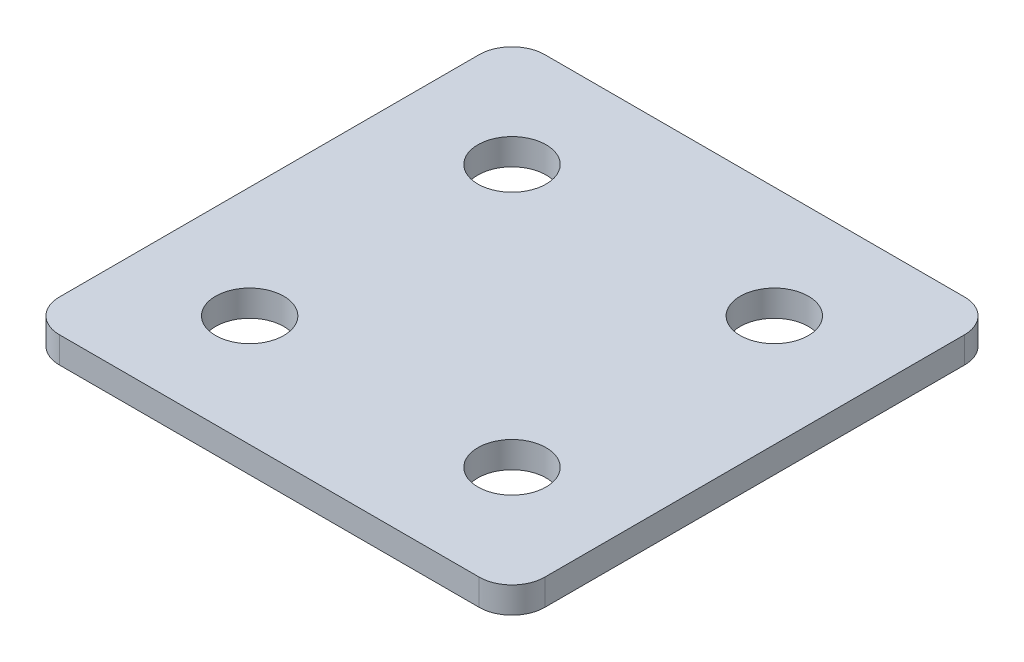
ISO-10303-21;
HEADER;
FILE_DESCRIPTION(('STEP AP214'),'2;1');
FILE_NAME('part.step','',(''),(''),'','','');
FILE_SCHEMA(('AUTOMOTIVE_DESIGN { 1 0 10303 214 1 1 1 1 }'));
ENDSEC;
DATA;
#1=APPLICATION_CONTEXT('core data for automotive mechanical design processes');
#2=APPLICATION_PROTOCOL_DEFINITION('international standard','automotive_design',2000,#1);
#3=PRODUCT_CONTEXT('',#1,'mechanical');
#4=PRODUCT('Part','Part','',(#3));
#5=PRODUCT_RELATED_PRODUCT_CATEGORY('part','',(#4));
#6=PRODUCT_DEFINITION_FORMATION('','',#4);
#7=PRODUCT_DEFINITION_CONTEXT('part definition',#1,'design');
#8=PRODUCT_DEFINITION('design','',#6,#7);
#9=PRODUCT_DEFINITION_SHAPE('','',#8);
#10=(LENGTH_UNIT() NAMED_UNIT(*) SI_UNIT(.MILLI.,.METRE.));
#11=(NAMED_UNIT(*) PLANE_ANGLE_UNIT() SI_UNIT($,.RADIAN.));
#12=(NAMED_UNIT(*) SI_UNIT($,.STERADIAN.) SOLID_ANGLE_UNIT());
#13=UNCERTAINTY_MEASURE_WITH_UNIT(LENGTH_MEASURE(1.E-05),#10,'distance_accuracy_value','');
#14=(GEOMETRIC_REPRESENTATION_CONTEXT(3) GLOBAL_UNCERTAINTY_ASSIGNED_CONTEXT((#13)) GLOBAL_UNIT_ASSIGNED_CONTEXT((#10,
#11,#12)) REPRESENTATION_CONTEXT('',''));
#15=CARTESIAN_POINT('',(0.,0.,0.));
#16=DIRECTION('',(0.,0.,1.));
#17=DIRECTION('',(1.,0.,0.));
#18=AXIS2_PLACEMENT_3D('',#15,#16,#17);
#19=CARTESIAN_POINT('',(-1.04930424271288,1.27470932668439,-11.2250354101297));
#20=DIRECTION('',(0.,-1.,0.));
#21=DIRECTION('',(0.,0.,-1.));
#22=AXIS2_PLACEMENT_3D('',#19,#20,#21);
#23=PLANE('',#22);
#24=CARTESIAN_POINT('',(8.95069575728713,1.27470932668439,8.77496458987029));
#25=DIRECTION('',(0.,1.,0.));
#26=DIRECTION('',(0.,0.,1.));
#27=AXIS2_PLACEMENT_3D('',#24,#25,#26);
#28=CIRCLE('',#27,2.6);
#29=CARTESIAN_POINT('',(8.95069575728713,1.27470932668439,11.3749645898703));
#30=VERTEX_POINT('',#29);
#31=EDGE_CURVE('E165',#30,#30,#28,.T.);
#32=ORIENTED_EDGE('',*,*,#31,.T.);
#33=EDGE_LOOP('',(#32));
#34=FACE_BOUND('',#33,.T.);
#35=CARTESIAN_POINT('',(-11.0493042427129,1.27470932668439,8.77496458987029));
#36=DIRECTION('',(0.,1.,0.));
#37=DIRECTION('',(0.,0.,1.));
#38=AXIS2_PLACEMENT_3D('',#35,#36,#37);
#39=CIRCLE('',#38,2.6);
#40=CARTESIAN_POINT('',(-11.0493042427129,1.27470932668439,11.3749645898703));
#41=VERTEX_POINT('',#40);
#42=EDGE_CURVE('E159',#41,#41,#39,.T.);
#43=ORIENTED_EDGE('',*,*,#42,.T.);
#44=EDGE_LOOP('',(#43));
#45=FACE_BOUND('',#44,.T.);
#46=CARTESIAN_POINT('',(8.95069575728714,1.27470932668439,-11.2250354101297));
#47=DIRECTION('',(0.,1.,0.));
#48=DIRECTION('',(0.,0.,1.));
#49=AXIS2_PLACEMENT_3D('',#46,#47,#48);
#50=CIRCLE('',#49,2.6);
#51=CARTESIAN_POINT('',(8.95069575728714,1.27470932668439,-8.62503541012971));
#52=VERTEX_POINT('',#51);
#53=EDGE_CURVE('E154',#52,#52,#50,.T.);
#54=ORIENTED_EDGE('',*,*,#53,.T.);
#55=EDGE_LOOP('',(#54));
#56=FACE_BOUND('',#55,.T.);
#57=CARTESIAN_POINT('',(-11.0493042427129,1.27470932668439,-11.2250354101297));
#58=DIRECTION('',(0.,1.,0.));
#59=DIRECTION('',(0.,0.,1.));
#60=AXIS2_PLACEMENT_3D('',#57,#58,#59);
#61=CIRCLE('',#60,2.6);
#62=CARTESIAN_POINT('',(-11.0493042427129,1.27470932668439,-8.62503541012971));
#63=VERTEX_POINT('',#62);
#64=EDGE_CURVE('E147',#63,#63,#61,.T.);
#65=ORIENTED_EDGE('',*,*,#64,.T.);
#66=EDGE_LOOP('',(#65));
#67=FACE_BOUND('',#66,.T.);
#68=DIRECTION('',(0.,0.,-1.));
#69=VECTOR('',#68,1.);
#70=CARTESIAN_POINT('',(17.4506957572872,1.27470932668439,17.2749645898703));
#71=LINE('',#70,#69);
#72=CARTESIAN_POINT('',(17.4506957572872,1.27470932668439,14.7749645898703));
#73=VERTEX_POINT('',#72);
#74=CARTESIAN_POINT('',(17.4506957572872,1.27470932668439,-17.2250354101298));
#75=VERTEX_POINT('',#74);
#76=EDGE_CURVE('E106',#73,#75,#71,.T.);
#77=ORIENTED_EDGE('',*,*,#76,.F.);
#78=CARTESIAN_POINT('',(14.9506957572872,1.27470932668439,14.7749645898703));
#79=DIRECTION('',(0.,-1.,0.));
#80=DIRECTION('',(0.,0.,-1.));
#81=AXIS2_PLACEMENT_3D('',#78,#79,#80);
#82=CIRCLE('',#81,2.5);
#83=CARTESIAN_POINT('',(14.9506957572872,1.27470932668439,17.2749645898703));
#84=VERTEX_POINT('',#83);
#85=EDGE_CURVE('E128',#73,#84,#82,.T.);
#86=ORIENTED_EDGE('',*,*,#85,.T.);
#87=DIRECTION('',(1.,0.,0.));
#88=VECTOR('',#87,1.);
#89=CARTESIAN_POINT('',(-19.5493042427129,1.27470932668439,17.2749645898703));
#90=LINE('',#89,#88);
#91=CARTESIAN_POINT('',(-17.0493042427129,1.27470932668439,17.2749645898703));
#92=VERTEX_POINT('',#91);
#93=EDGE_CURVE('E110',#92,#84,#90,.T.);
#94=ORIENTED_EDGE('',*,*,#93,.F.);
#95=CARTESIAN_POINT('',(-17.0493042427129,1.27470932668439,14.7749645898703));
#96=DIRECTION('',(0.,-1.,0.));
#97=DIRECTION('',(0.,0.,-1.));
#98=AXIS2_PLACEMENT_3D('',#95,#96,#97);
#99=CIRCLE('',#98,2.5);
#100=CARTESIAN_POINT('',(-19.5493042427129,1.27470932668439,14.7749645898703));
#101=VERTEX_POINT('',#100);
#102=EDGE_CURVE('E105',#92,#101,#99,.T.);
#103=ORIENTED_EDGE('',*,*,#102,.T.);
#104=DIRECTION('',(0.,0.,1.));
#105=VECTOR('',#104,1.);
#106=CARTESIAN_POINT('',(-19.5493042427129,1.27470932668439,-19.7250354101298));
#107=LINE('',#106,#105);
#108=CARTESIAN_POINT('',(-19.5493042427129,1.27470932668439,-17.2250354101297));
#109=VERTEX_POINT('',#108);
#110=EDGE_CURVE('E137',#109,#101,#107,.T.);
#111=ORIENTED_EDGE('',*,*,#110,.F.);
#112=CARTESIAN_POINT('',(-17.0493042427129,1.27470932668439,-17.2250354101297));
#113=DIRECTION('',(0.,-1.,0.));
#114=DIRECTION('',(0.,0.,-1.));
#115=AXIS2_PLACEMENT_3D('',#112,#113,#114);
#116=CIRCLE('',#115,2.5);
#117=CARTESIAN_POINT('',(-17.0493042427129,1.27470932668439,-19.7250354101298));
#118=VERTEX_POINT('',#117);
#119=EDGE_CURVE('E31',#109,#118,#116,.T.);
#120=ORIENTED_EDGE('',*,*,#119,.T.);
#121=DIRECTION('',(-1.,0.,0.));
#122=VECTOR('',#121,1.);
#123=CARTESIAN_POINT('',(17.4506957572872,1.27470932668439,-19.7250354101298));
#124=LINE('',#123,#122);
#125=CARTESIAN_POINT('',(14.9506957572872,1.27470932668439,-19.7250354101298));
#126=VERTEX_POINT('',#125);
#127=EDGE_CURVE('E138',#126,#118,#124,.T.);
#128=ORIENTED_EDGE('',*,*,#127,.F.);
#129=CARTESIAN_POINT('',(14.9506957572872,1.27470932668439,-17.2250354101298));
#130=DIRECTION('',(0.,-1.,0.));
#131=DIRECTION('',(0.,0.,-1.));
#132=AXIS2_PLACEMENT_3D('',#129,#130,#131);
#133=CIRCLE('',#132,2.5);
#134=EDGE_CURVE('E126',#126,#75,#133,.T.);
#135=ORIENTED_EDGE('',*,*,#134,.T.);
#136=EDGE_LOOP('',(#77,#86,#94,#103,#111,#120,#128,#135));
#137=FACE_BOUND('',#136,.T.);
#138=ADVANCED_FACE('F16',(#34,#45,#56,#67,#137),#23,.T.);
#139=CARTESIAN_POINT('',(17.4506957572872,1.27470932668439,-19.7250354101298));
#140=DIRECTION('',(0.,0.,-1.));
#141=DIRECTION('',(-1.,0.,0.));
#142=AXIS2_PLACEMENT_3D('',#139,#140,#141);
#143=PLANE('',#142);
#144=DIRECTION('',(-1.,0.,0.));
#145=VECTOR('',#144,1.);
#146=CARTESIAN_POINT('',(17.4506957572872,3.27470932668439,-19.7250354101298));
#147=LINE('',#146,#145);
#148=CARTESIAN_POINT('',(14.9506957572872,3.27470932668439,-19.7250354101298));
#149=VERTEX_POINT('',#148);
#150=CARTESIAN_POINT('',(-17.0493042427129,3.27470932668439,-19.7250354101298));
#151=VERTEX_POINT('',#150);
#152=EDGE_CURVE('E144',#149,#151,#147,.T.);
#153=ORIENTED_EDGE('',*,*,#152,.F.);
#154=DIRECTION('',(0.,1.,0.));
#155=VECTOR('',#154,1.);
#156=CARTESIAN_POINT('',(14.9506957572872,1.27470932668439,-19.7250354101298));
#157=LINE('',#156,#155);
#158=EDGE_CURVE('E38',#149,#126,#157,.F.);
#159=ORIENTED_EDGE('',*,*,#158,.T.);
#160=ORIENTED_EDGE('',*,*,#127,.T.);
#161=DIRECTION('',(0.,1.,0.));
#162=VECTOR('',#161,1.);
#163=CARTESIAN_POINT('',(-17.0493042427129,1.27470932668439,-19.7250354101298));
#164=LINE('',#163,#162);
#165=EDGE_CURVE('E130',#118,#151,#164,.T.);
#166=ORIENTED_EDGE('',*,*,#165,.T.);
#167=EDGE_LOOP('',(#153,#159,#160,#166));
#168=FACE_BOUND('',#167,.T.);
#169=ADVANCED_FACE('F206',(#168),#143,.T.);
#170=CARTESIAN_POINT('',(17.4506957572872,1.27470932668439,17.2749645898703));
#171=DIRECTION('',(1.,0.,0.));
#172=DIRECTION('',(0.,0.,-1.));
#173=AXIS2_PLACEMENT_3D('',#170,#171,#172);
#174=PLANE('',#173);
#175=DIRECTION('',(0.,0.,-1.));
#176=VECTOR('',#175,1.);
#177=CARTESIAN_POINT('',(17.4506957572872,3.27470932668439,17.2749645898703));
#178=LINE('',#177,#176);
#179=CARTESIAN_POINT('',(17.4506957572872,3.27470932668439,14.7749645898703));
#180=VERTEX_POINT('',#179);
#181=CARTESIAN_POINT('',(17.4506957572872,3.27470932668439,-17.2250354101298));
#182=VERTEX_POINT('',#181);
#183=EDGE_CURVE('E102',#180,#182,#178,.T.);
#184=ORIENTED_EDGE('',*,*,#183,.F.);
#185=DIRECTION('',(0.,1.,0.));
#186=VECTOR('',#185,1.);
#187=CARTESIAN_POINT('',(17.4506957572872,1.27470932668439,14.7749645898703));
#188=LINE('',#187,#186);
#189=EDGE_CURVE('E122',#180,#73,#188,.F.);
#190=ORIENTED_EDGE('',*,*,#189,.T.);
#191=ORIENTED_EDGE('',*,*,#76,.T.);
#192=DIRECTION('',(0.,1.,0.));
#193=VECTOR('',#192,1.);
#194=CARTESIAN_POINT('',(17.4506957572872,1.27470932668439,-17.2250354101298));
#195=LINE('',#194,#193);
#196=EDGE_CURVE('E119',#75,#182,#195,.T.);
#197=ORIENTED_EDGE('',*,*,#196,.T.);
#198=EDGE_LOOP('',(#184,#190,#191,#197));
#199=FACE_BOUND('',#198,.T.);
#200=ADVANCED_FACE('F211',(#199),#174,.T.);
#201=CARTESIAN_POINT('',(-19.5493042427129,1.27470932668439,17.2749645898703));
#202=DIRECTION('',(0.,0.,1.));
#203=DIRECTION('',(1.,0.,0.));
#204=AXIS2_PLACEMENT_3D('',#201,#202,#203);
#205=PLANE('',#204);
#206=ORIENTED_EDGE('',*,*,#93,.T.);
#207=DIRECTION('',(0.,1.,0.));
#208=VECTOR('',#207,1.);
#209=CARTESIAN_POINT('',(14.9506957572872,1.27470932668439,17.2749645898703));
#210=LINE('',#209,#208);
#211=CARTESIAN_POINT('',(14.9506957572872,3.27470932668439,17.2749645898703));
#212=VERTEX_POINT('',#211);
#213=EDGE_CURVE('E93',#84,#212,#210,.T.);
#214=ORIENTED_EDGE('',*,*,#213,.T.);
#215=DIRECTION('',(1.,0.,0.));
#216=VECTOR('',#215,1.);
#217=CARTESIAN_POINT('',(-19.5493042427129,3.27470932668439,17.2749645898703));
#218=LINE('',#217,#216);
#219=CARTESIAN_POINT('',(-17.0493042427129,3.27470932668439,17.2749645898703));
#220=VERTEX_POINT('',#219);
#221=EDGE_CURVE('E85',#220,#212,#218,.T.);
#222=ORIENTED_EDGE('',*,*,#221,.F.);
#223=DIRECTION('',(0.,1.,0.));
#224=VECTOR('',#223,1.);
#225=CARTESIAN_POINT('',(-17.0493042427129,1.27470932668439,17.2749645898703));
#226=LINE('',#225,#224);
#227=EDGE_CURVE('E99',#220,#92,#226,.F.);
#228=ORIENTED_EDGE('',*,*,#227,.T.);
#229=EDGE_LOOP('',(#206,#214,#222,#228));
#230=FACE_BOUND('',#229,.T.);
#231=ADVANCED_FACE('F98',(#230),#205,.T.);
#232=CARTESIAN_POINT('',(-19.5493042427129,1.27470932668439,-19.7250354101298));
#233=DIRECTION('',(-1.,0.,0.));
#234=DIRECTION('',(0.,0.,1.));
#235=AXIS2_PLACEMENT_3D('',#232,#233,#234);
#236=PLANE('',#235);
#237=DIRECTION('',(0.,0.,1.));
#238=VECTOR('',#237,1.);
#239=CARTESIAN_POINT('',(-19.5493042427129,3.27470932668439,-19.7250354101298));
#240=LINE('',#239,#238);
#241=CARTESIAN_POINT('',(-19.5493042427129,3.27470932668439,-17.2250354101297));
#242=VERTEX_POINT('',#241);
#243=CARTESIAN_POINT('',(-19.5493042427129,3.27470932668439,14.7749645898703));
#244=VERTEX_POINT('',#243);
#245=EDGE_CURVE('E87',#242,#244,#240,.T.);
#246=ORIENTED_EDGE('',*,*,#245,.F.);
#247=DIRECTION('',(0.,1.,0.));
#248=VECTOR('',#247,1.);
#249=CARTESIAN_POINT('',(-19.5493042427129,1.27470932668439,-17.2250354101297));
#250=LINE('',#249,#248);
#251=EDGE_CURVE('E10',#242,#109,#250,.F.);
#252=ORIENTED_EDGE('',*,*,#251,.T.);
#253=ORIENTED_EDGE('',*,*,#110,.T.);
#254=DIRECTION('',(0.,1.,0.));
#255=VECTOR('',#254,1.);
#256=CARTESIAN_POINT('',(-19.5493042427129,1.27470932668439,14.7749645898703));
#257=LINE('',#256,#255);
#258=EDGE_CURVE('E24',#101,#244,#257,.T.);
#259=ORIENTED_EDGE('',*,*,#258,.T.);
#260=EDGE_LOOP('',(#246,#252,#253,#259));
#261=FACE_BOUND('',#260,.T.);
#262=ADVANCED_FACE('F135',(#261),#236,.T.);
#263=CARTESIAN_POINT('',(-1.04930424271288,3.27470932668439,-11.2250354101297));
#264=DIRECTION('',(0.,-1.,0.));
#265=DIRECTION('',(0.,0.,-1.));
#266=AXIS2_PLACEMENT_3D('',#263,#264,#265);
#267=PLANE('',#266);
#268=CARTESIAN_POINT('',(8.95069575728713,3.27470932668439,8.77496458987029));
#269=DIRECTION('',(0.,1.,0.));
#270=DIRECTION('',(0.,0.,1.));
#271=AXIS2_PLACEMENT_3D('',#268,#269,#270);
#272=CIRCLE('',#271,2.6);
#273=CARTESIAN_POINT('',(8.95069575728713,3.27470932668439,11.3749645898703));
#274=VERTEX_POINT('',#273);
#275=EDGE_CURVE('E168',#274,#274,#272,.T.);
#276=ORIENTED_EDGE('',*,*,#275,.F.);
#277=EDGE_LOOP('',(#276));
#278=FACE_BOUND('',#277,.T.);
#279=CARTESIAN_POINT('',(-11.0493042427129,3.27470932668439,8.77496458987029));
#280=DIRECTION('',(0.,1.,0.));
#281=DIRECTION('',(0.,0.,1.));
#282=AXIS2_PLACEMENT_3D('',#279,#280,#281);
#283=CIRCLE('',#282,2.6);
#284=CARTESIAN_POINT('',(-11.0493042427129,3.27470932668439,11.3749645898703));
#285=VERTEX_POINT('',#284);
#286=EDGE_CURVE('E162',#285,#285,#283,.T.);
#287=ORIENTED_EDGE('',*,*,#286,.F.);
#288=EDGE_LOOP('',(#287));
#289=FACE_BOUND('',#288,.T.);
#290=CARTESIAN_POINT('',(8.95069575728714,3.27470932668439,-11.2250354101297));
#291=DIRECTION('',(0.,1.,0.));
#292=DIRECTION('',(0.,0.,1.));
#293=AXIS2_PLACEMENT_3D('',#290,#291,#292);
#294=CIRCLE('',#293,2.6);
#295=CARTESIAN_POINT('',(8.95069575728714,3.27470932668439,-8.62503541012971));
#296=VERTEX_POINT('',#295);
#297=EDGE_CURVE('E156',#296,#296,#294,.T.);
#298=ORIENTED_EDGE('',*,*,#297,.F.);
#299=EDGE_LOOP('',(#298));
#300=FACE_BOUND('',#299,.T.);
#301=CARTESIAN_POINT('',(-11.0493042427129,3.27470932668439,-11.2250354101297));
#302=DIRECTION('',(0.,1.,0.));
#303=DIRECTION('',(0.,0.,1.));
#304=AXIS2_PLACEMENT_3D('',#301,#302,#303);
#305=CIRCLE('',#304,2.6);
#306=CARTESIAN_POINT('',(-11.0493042427129,3.27470932668439,-8.62503541012971));
#307=VERTEX_POINT('',#306);
#308=EDGE_CURVE('E149',#307,#307,#305,.T.);
#309=ORIENTED_EDGE('',*,*,#308,.F.);
#310=EDGE_LOOP('',(#309));
#311=FACE_BOUND('',#310,.T.);
#312=ORIENTED_EDGE('',*,*,#221,.T.);
#313=CARTESIAN_POINT('',(14.9506957572872,3.27470932668439,14.7749645898703));
#314=DIRECTION('',(0.,-1.,0.));
#315=DIRECTION('',(0.,0.,-1.));
#316=AXIS2_PLACEMENT_3D('',#313,#314,#315);
#317=CIRCLE('',#316,2.5);
#318=EDGE_CURVE('E117',#212,#180,#317,.F.);
#319=ORIENTED_EDGE('',*,*,#318,.T.);
#320=ORIENTED_EDGE('',*,*,#183,.T.);
#321=CARTESIAN_POINT('',(14.9506957572872,3.27470932668439,-17.2250354101298));
#322=DIRECTION('',(0.,-1.,0.));
#323=DIRECTION('',(0.,0.,-1.));
#324=AXIS2_PLACEMENT_3D('',#321,#322,#323);
#325=CIRCLE('',#324,2.5);
#326=EDGE_CURVE('E115',#182,#149,#325,.F.);
#327=ORIENTED_EDGE('',*,*,#326,.T.);
#328=ORIENTED_EDGE('',*,*,#152,.T.);
#329=CARTESIAN_POINT('',(-17.0493042427129,3.27470932668439,-17.2250354101297));
#330=DIRECTION('',(0.,-1.,0.));
#331=DIRECTION('',(0.,0.,-1.));
#332=AXIS2_PLACEMENT_3D('',#329,#330,#331);
#333=CIRCLE('',#332,2.5);
#334=EDGE_CURVE('E92',#151,#242,#333,.F.);
#335=ORIENTED_EDGE('',*,*,#334,.T.);
#336=ORIENTED_EDGE('',*,*,#245,.T.);
#337=CARTESIAN_POINT('',(-17.0493042427129,3.27470932668439,14.7749645898703));
#338=DIRECTION('',(0.,-1.,0.));
#339=DIRECTION('',(0.,0.,-1.));
#340=AXIS2_PLACEMENT_3D('',#337,#338,#339);
#341=CIRCLE('',#340,2.5);
#342=EDGE_CURVE('E82',#244,#220,#341,.F.);
#343=ORIENTED_EDGE('',*,*,#342,.T.);
#344=EDGE_LOOP('',(#312,#319,#320,#327,#328,#335,#336,#343));
#345=FACE_BOUND('',#344,.T.);
#346=ADVANCED_FACE('F84',(#278,#289,#300,#311,#345),#267,.F.);
#347=CARTESIAN_POINT('',(-11.0493042427129,1.27470932668439,-11.2250354101297));
#348=DIRECTION('',(0.,1.,0.));
#349=DIRECTION('',(0.,0.,1.));
#350=AXIS2_PLACEMENT_3D('',#347,#348,#349);
#351=CYLINDRICAL_SURFACE('',#350,2.6);
#352=ORIENTED_EDGE('',*,*,#64,.F.);
#353=EDGE_LOOP('',(#352));
#354=FACE_BOUND('',#353,.T.);
#355=ORIENTED_EDGE('',*,*,#308,.T.);
#356=EDGE_LOOP('',(#355));
#357=FACE_BOUND('',#356,.T.);
#358=ADVANCED_FACE('F186',(#354,#357),#351,.F.);
#359=CARTESIAN_POINT('',(8.95069575728714,1.27470932668439,-11.2250354101297));
#360=DIRECTION('',(0.,1.,0.));
#361=DIRECTION('',(0.,0.,1.));
#362=AXIS2_PLACEMENT_3D('',#359,#360,#361);
#363=CYLINDRICAL_SURFACE('',#362,2.6);
#364=ORIENTED_EDGE('',*,*,#53,.F.);
#365=EDGE_LOOP('',(#364));
#366=FACE_BOUND('',#365,.T.);
#367=ORIENTED_EDGE('',*,*,#297,.T.);
#368=EDGE_LOOP('',(#367));
#369=FACE_BOUND('',#368,.T.);
#370=ADVANCED_FACE('F195',(#366,#369),#363,.F.);
#371=CARTESIAN_POINT('',(-11.0493042427129,1.27470932668439,8.77496458987029));
#372=DIRECTION('',(0.,1.,0.));
#373=DIRECTION('',(0.,0.,1.));
#374=AXIS2_PLACEMENT_3D('',#371,#372,#373);
#375=CYLINDRICAL_SURFACE('',#374,2.6);
#376=ORIENTED_EDGE('',*,*,#42,.F.);
#377=EDGE_LOOP('',(#376));
#378=FACE_BOUND('',#377,.T.);
#379=ORIENTED_EDGE('',*,*,#286,.T.);
#380=EDGE_LOOP('',(#379));
#381=FACE_BOUND('',#380,.T.);
#382=ADVANCED_FACE('F180',(#378,#381),#375,.F.);
#383=CARTESIAN_POINT('',(8.95069575728713,1.27470932668439,8.77496458987029));
#384=DIRECTION('',(0.,1.,0.));
#385=DIRECTION('',(0.,0.,1.));
#386=AXIS2_PLACEMENT_3D('',#383,#384,#385);
#387=CYLINDRICAL_SURFACE('',#386,2.6);
#388=ORIENTED_EDGE('',*,*,#31,.F.);
#389=EDGE_LOOP('',(#388));
#390=FACE_BOUND('',#389,.T.);
#391=ORIENTED_EDGE('',*,*,#275,.T.);
#392=EDGE_LOOP('',(#391));
#393=FACE_BOUND('',#392,.T.);
#394=ADVANCED_FACE('F176',(#390,#393),#387,.F.);
#395=CARTESIAN_POINT('',(14.9506957572872,1.27470932668439,14.7749645898703));
#396=DIRECTION('',(0.,1.,0.));
#397=DIRECTION('',(0.,0.,1.));
#398=AXIS2_PLACEMENT_3D('',#395,#396,#397);
#399=CYLINDRICAL_SURFACE('',#398,2.5);
#400=ORIENTED_EDGE('',*,*,#85,.F.);
#401=ORIENTED_EDGE('',*,*,#189,.F.);
#402=ORIENTED_EDGE('',*,*,#318,.F.);
#403=ORIENTED_EDGE('',*,*,#213,.F.);
#404=EDGE_LOOP('',(#400,#401,#402,#403));
#405=FACE_BOUND('',#404,.T.);
#406=ADVANCED_FACE('F179',(#405),#399,.T.);
#407=CARTESIAN_POINT('',(14.9506957572872,1.27470932668439,-17.2250354101298));
#408=DIRECTION('',(0.,1.,0.));
#409=DIRECTION('',(0.,0.,1.));
#410=AXIS2_PLACEMENT_3D('',#407,#408,#409);
#411=CYLINDRICAL_SURFACE('',#410,2.5);
#412=ORIENTED_EDGE('',*,*,#134,.F.);
#413=ORIENTED_EDGE('',*,*,#158,.F.);
#414=ORIENTED_EDGE('',*,*,#326,.F.);
#415=ORIENTED_EDGE('',*,*,#196,.F.);
#416=EDGE_LOOP('',(#412,#413,#414,#415));
#417=FACE_BOUND('',#416,.T.);
#418=ADVANCED_FACE('F216',(#417),#411,.T.);
#419=CARTESIAN_POINT('',(-17.0493042427129,1.27470932668439,-17.2250354101297));
#420=DIRECTION('',(0.,1.,0.));
#421=DIRECTION('',(0.,0.,1.));
#422=AXIS2_PLACEMENT_3D('',#419,#420,#421);
#423=CYLINDRICAL_SURFACE('',#422,2.5);
#424=ORIENTED_EDGE('',*,*,#119,.F.);
#425=ORIENTED_EDGE('',*,*,#251,.F.);
#426=ORIENTED_EDGE('',*,*,#334,.F.);
#427=ORIENTED_EDGE('',*,*,#165,.F.);
#428=EDGE_LOOP('',(#424,#425,#426,#427));
#429=FACE_BOUND('',#428,.T.);
#430=ADVANCED_FACE('F219',(#429),#423,.T.);
#431=CARTESIAN_POINT('',(-17.0493042427129,1.27470932668439,14.7749645898703));
#432=DIRECTION('',(0.,1.,0.));
#433=DIRECTION('',(0.,0.,1.));
#434=AXIS2_PLACEMENT_3D('',#431,#432,#433);
#435=CYLINDRICAL_SURFACE('',#434,2.5);
#436=ORIENTED_EDGE('',*,*,#102,.F.);
#437=ORIENTED_EDGE('',*,*,#227,.F.);
#438=ORIENTED_EDGE('',*,*,#342,.F.);
#439=ORIENTED_EDGE('',*,*,#258,.F.);
#440=EDGE_LOOP('',(#436,#437,#438,#439));
#441=FACE_BOUND('',#440,.T.);
#442=ADVANCED_FACE('F18',(#441),#435,.T.);
#443=CLOSED_SHELL('',(#138,#169,#200,#231,#262,#346,#358,#370,#382,#394,#406,#418,#430,#442));
#444=MANIFOLD_SOLID_BREP('B1',#443);
#445=ADVANCED_BREP_SHAPE_REPRESENTATION('',(#18,#444),#14);
#446=SHAPE_DEFINITION_REPRESENTATION(#9,#445);
ENDSEC;
END-ISO-10303-21;
